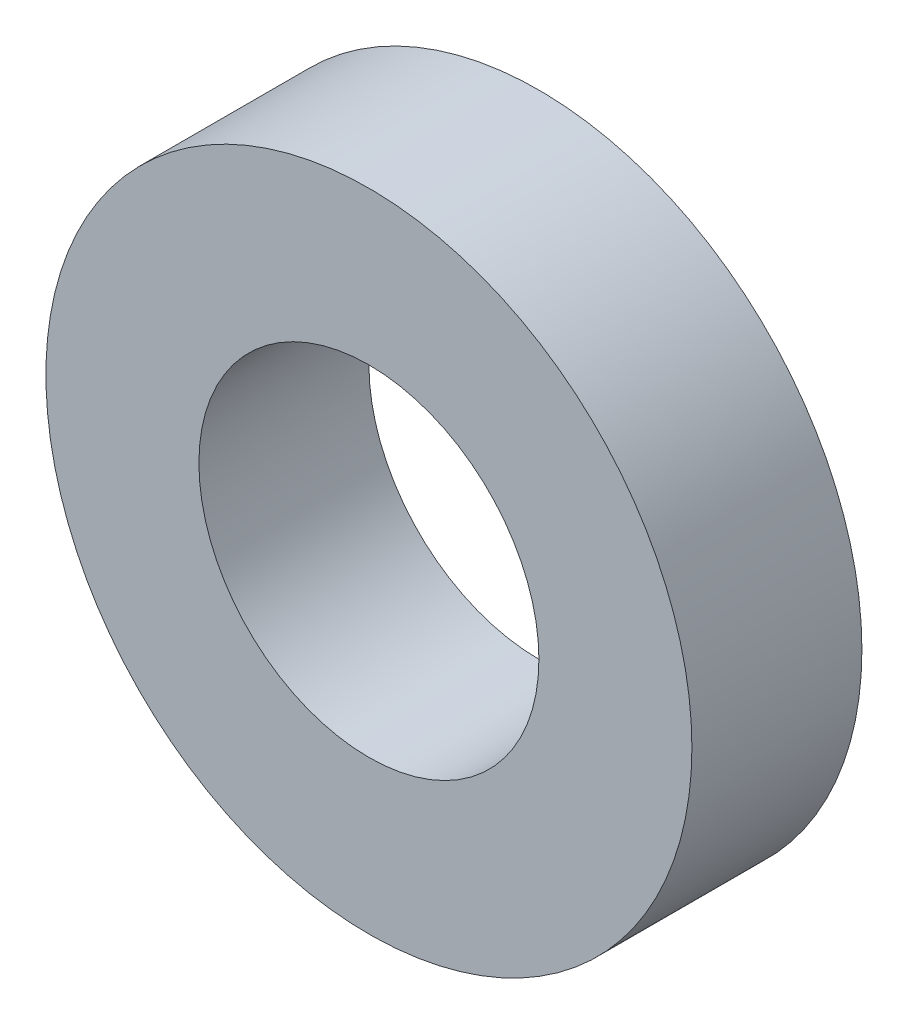
ISO-10303-21;
HEADER;
FILE_DESCRIPTION(('STEP AP214'),'2;1');
FILE_NAME('part.step','',(''),(''),'','','');
FILE_SCHEMA(('AUTOMOTIVE_DESIGN { 1 0 10303 214 1 1 1 1 }'));
ENDSEC;
DATA;
#1=APPLICATION_CONTEXT('core data for automotive mechanical design processes');
#2=APPLICATION_PROTOCOL_DEFINITION('international standard','automotive_design',2000,#1);
#3=PRODUCT_CONTEXT('',#1,'mechanical');
#4=PRODUCT('Part','Part','',(#3));
#5=PRODUCT_RELATED_PRODUCT_CATEGORY('part','',(#4));
#6=PRODUCT_DEFINITION_FORMATION('','',#4);
#7=PRODUCT_DEFINITION_CONTEXT('part definition',#1,'design');
#8=PRODUCT_DEFINITION('design','',#6,#7);
#9=PRODUCT_DEFINITION_SHAPE('','',#8);
#10=(LENGTH_UNIT() NAMED_UNIT(*) SI_UNIT(.MILLI.,.METRE.));
#11=(NAMED_UNIT(*) PLANE_ANGLE_UNIT() SI_UNIT($,.RADIAN.));
#12=(NAMED_UNIT(*) SI_UNIT($,.STERADIAN.) SOLID_ANGLE_UNIT());
#13=UNCERTAINTY_MEASURE_WITH_UNIT(LENGTH_MEASURE(1.E-05),#10,'distance_accuracy_value','');
#14=(GEOMETRIC_REPRESENTATION_CONTEXT(3) GLOBAL_UNCERTAINTY_ASSIGNED_CONTEXT((#13)) GLOBAL_UNIT_ASSIGNED_CONTEXT((#10,
#11,#12)) REPRESENTATION_CONTEXT('',''));
#15=CARTESIAN_POINT('',(0.,0.,0.));
#16=DIRECTION('',(0.,0.,1.));
#17=DIRECTION('',(1.,0.,0.));
#18=AXIS2_PLACEMENT_3D('',#15,#16,#17);
#19=CARTESIAN_POINT('',(0.,0.,5.));
#20=DIRECTION('',(0.,0.,-1.));
#21=DIRECTION('',(-1.,0.,0.));
#22=AXIS2_PLACEMENT_3D('',#19,#20,#21);
#23=CYLINDRICAL_SURFACE('',#22,9.5);
#24=CARTESIAN_POINT('',(0.,0.,5.));
#25=DIRECTION('',(0.,0.,1.));
#26=DIRECTION('',(1.,0.,0.));
#27=AXIS2_PLACEMENT_3D('',#24,#25,#26);
#28=CIRCLE('',#27,9.5);
#29=CARTESIAN_POINT('',(9.5,0.,5.));
#30=VERTEX_POINT('',#29);
#31=EDGE_CURVE('E10',#30,#30,#28,.T.);
#32=ORIENTED_EDGE('',*,*,#31,.F.);
#33=EDGE_LOOP('',(#32));
#34=FACE_BOUND('',#33,.T.);
#35=CARTESIAN_POINT('',(0.,0.,0.));
#36=DIRECTION('',(0.,0.,1.));
#37=DIRECTION('',(1.,0.,0.));
#38=AXIS2_PLACEMENT_3D('',#35,#36,#37);
#39=CIRCLE('',#38,9.5);
#40=CARTESIAN_POINT('',(9.5,0.,0.));
#41=VERTEX_POINT('',#40);
#42=EDGE_CURVE('E37',#41,#41,#39,.T.);
#43=ORIENTED_EDGE('',*,*,#42,.T.);
#44=EDGE_LOOP('',(#43));
#45=FACE_BOUND('',#44,.T.);
#46=ADVANCED_FACE('F30',(#34,#45),#23,.T.);
#47=CARTESIAN_POINT('',(0.,0.,5.));
#48=DIRECTION('',(0.,0.,1.));
#49=DIRECTION('',(1.,0.,0.));
#50=AXIS2_PLACEMENT_3D('',#47,#48,#49);
#51=PLANE('',#50);
#52=CARTESIAN_POINT('',(0.,0.,5.));
#53=DIRECTION('',(0.,0.,1.));
#54=DIRECTION('',(1.,0.,0.));
#55=AXIS2_PLACEMENT_3D('',#52,#53,#54);
#56=CIRCLE('',#55,5.);
#57=CARTESIAN_POINT('',(5.,0.,5.));
#58=VERTEX_POINT('',#57);
#59=EDGE_CURVE('E43',#58,#58,#56,.T.);
#60=ORIENTED_EDGE('',*,*,#59,.F.);
#61=EDGE_LOOP('',(#60));
#62=FACE_BOUND('',#61,.T.);
#63=ORIENTED_EDGE('',*,*,#31,.T.);
#64=EDGE_LOOP('',(#63));
#65=FACE_BOUND('',#64,.T.);
#66=ADVANCED_FACE('F59',(#62,#65),#51,.T.);
#67=CARTESIAN_POINT('',(0.,0.,0.));
#68=DIRECTION('',(0.,0.,1.));
#69=DIRECTION('',(1.,0.,0.));
#70=AXIS2_PLACEMENT_3D('',#67,#68,#69);
#71=PLANE('',#70);
#72=CARTESIAN_POINT('',(0.,0.,0.));
#73=DIRECTION('',(0.,0.,1.));
#74=DIRECTION('',(1.,0.,0.));
#75=AXIS2_PLACEMENT_3D('',#72,#73,#74);
#76=CIRCLE('',#75,5.);
#77=CARTESIAN_POINT('',(5.,0.,0.));
#78=VERTEX_POINT('',#77);
#79=EDGE_CURVE('E33',#78,#78,#76,.T.);
#80=ORIENTED_EDGE('',*,*,#79,.T.);
#81=EDGE_LOOP('',(#80));
#82=FACE_BOUND('',#81,.T.);
#83=ORIENTED_EDGE('',*,*,#42,.F.);
#84=EDGE_LOOP('',(#83));
#85=FACE_BOUND('',#84,.T.);
#86=ADVANCED_FACE('F50',(#82,#85),#71,.F.);
#87=CARTESIAN_POINT('',(0.,0.,-1.35));
#88=DIRECTION('',(0.,0.,1.));
#89=DIRECTION('',(1.,0.,0.));
#90=AXIS2_PLACEMENT_3D('',#87,#88,#89);
#91=CYLINDRICAL_SURFACE('',#90,5.);
#92=ORIENTED_EDGE('',*,*,#59,.T.);
#93=EDGE_LOOP('',(#92));
#94=FACE_BOUND('',#93,.T.);
#95=ORIENTED_EDGE('',*,*,#79,.F.);
#96=EDGE_LOOP('',(#95));
#97=FACE_BOUND('',#96,.T.);
#98=ADVANCED_FACE('F53',(#94,#97),#91,.F.);
#99=CLOSED_SHELL('',(#46,#66,#86,#98));
#100=MANIFOLD_SOLID_BREP('B2',#99);
#101=ADVANCED_BREP_SHAPE_REPRESENTATION('',(#18,#100),#14);
#102=SHAPE_DEFINITION_REPRESENTATION(#9,#101);
ENDSEC;
END-ISO-10303-21;
